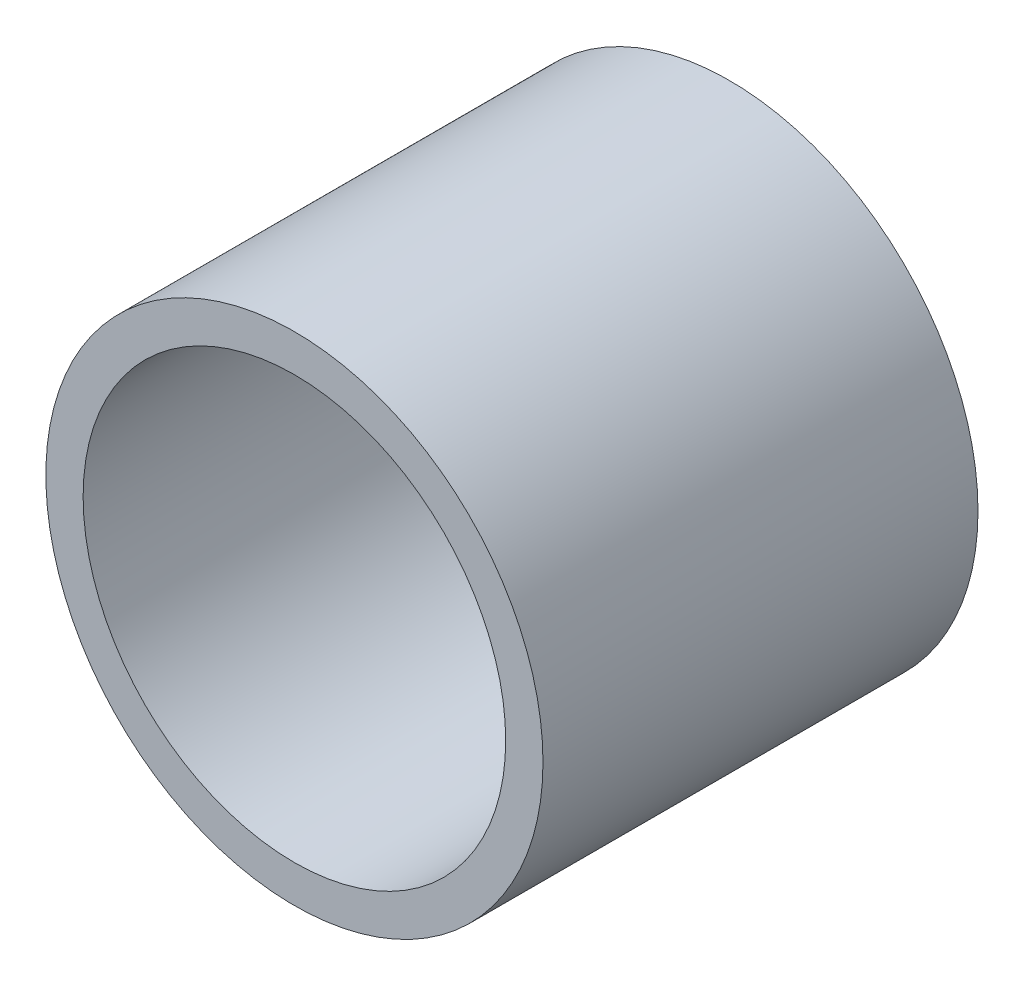
ISO-10303-21;
HEADER;
FILE_DESCRIPTION(('STEP AP214'),'2;1');
FILE_NAME('part.step','',(''),(''),'','','');
FILE_SCHEMA(('AUTOMOTIVE_DESIGN { 1 0 10303 214 1 1 1 1 }'));
ENDSEC;
DATA;
#1=APPLICATION_CONTEXT('core data for automotive mechanical design processes');
#2=APPLICATION_PROTOCOL_DEFINITION('international standard','automotive_design',2000,#1);
#3=PRODUCT_CONTEXT('',#1,'mechanical');
#4=PRODUCT('Part','Part','',(#3));
#5=PRODUCT_RELATED_PRODUCT_CATEGORY('part','',(#4));
#6=PRODUCT_DEFINITION_FORMATION('','',#4);
#7=PRODUCT_DEFINITION_CONTEXT('part definition',#1,'design');
#8=PRODUCT_DEFINITION('design','',#6,#7);
#9=PRODUCT_DEFINITION_SHAPE('','',#8);
#10=(LENGTH_UNIT() NAMED_UNIT(*) SI_UNIT(.MILLI.,.METRE.));
#11=(NAMED_UNIT(*) PLANE_ANGLE_UNIT() SI_UNIT($,.RADIAN.));
#12=(NAMED_UNIT(*) SI_UNIT($,.STERADIAN.) SOLID_ANGLE_UNIT());
#13=UNCERTAINTY_MEASURE_WITH_UNIT(LENGTH_MEASURE(1.E-05),#10,'distance_accuracy_value','');
#14=(GEOMETRIC_REPRESENTATION_CONTEXT(3) GLOBAL_UNCERTAINTY_ASSIGNED_CONTEXT((#13)) GLOBAL_UNIT_ASSIGNED_CONTEXT((#10,
#11,#12)) REPRESENTATION_CONTEXT('',''));
#15=CARTESIAN_POINT('',(0.,0.,0.));
#16=DIRECTION('',(0.,0.,1.));
#17=DIRECTION('',(1.,0.,0.));
#18=AXIS2_PLACEMENT_3D('',#15,#16,#17);
#19=CARTESIAN_POINT('',(0.,0.,44.45));
#20=DIRECTION('',(0.,0.,1.));
#21=DIRECTION('',(1.,0.,0.));
#22=AXIS2_PLACEMENT_3D('',#19,#20,#21);
#23=PLANE('',#22);
#24=CARTESIAN_POINT('',(0.,0.,44.45));
#25=DIRECTION('',(0.,0.,1.));
#26=DIRECTION('',(1.,0.,0.));
#27=AXIS2_PLACEMENT_3D('',#24,#25,#26);
#28=CIRCLE('',#27,25.4);
#29=CARTESIAN_POINT('',(25.4,0.,44.45));
#30=VERTEX_POINT('',#29);
#31=EDGE_CURVE('E10',#30,#30,#28,.T.);
#32=ORIENTED_EDGE('',*,*,#31,.T.);
#33=EDGE_LOOP('',(#32));
#34=FACE_BOUND('',#33,.T.);
#35=CARTESIAN_POINT('',(0.,0.,44.45));
#36=DIRECTION('',(0.,0.,1.));
#37=DIRECTION('',(1.,0.,0.));
#38=AXIS2_PLACEMENT_3D('',#35,#36,#37);
#39=CIRCLE('',#38,21.59);
#40=CARTESIAN_POINT('',(21.59,0.,44.45));
#41=VERTEX_POINT('',#40);
#42=EDGE_CURVE('E42',#41,#41,#39,.T.);
#43=ORIENTED_EDGE('',*,*,#42,.F.);
#44=EDGE_LOOP('',(#43));
#45=FACE_BOUND('',#44,.T.);
#46=ADVANCED_FACE('F31',(#34,#45),#23,.T.);
#47=CARTESIAN_POINT('',(0.,0.,0.));
#48=DIRECTION('',(0.,0.,1.));
#49=DIRECTION('',(1.,0.,0.));
#50=AXIS2_PLACEMENT_3D('',#47,#48,#49);
#51=PLANE('',#50);
#52=CARTESIAN_POINT('',(0.,0.,0.));
#53=DIRECTION('',(0.,0.,1.));
#54=DIRECTION('',(1.,0.,0.));
#55=AXIS2_PLACEMENT_3D('',#52,#53,#54);
#56=CIRCLE('',#55,25.4);
#57=CARTESIAN_POINT('',(25.4,0.,0.));
#58=VERTEX_POINT('',#57);
#59=EDGE_CURVE('E35',#58,#58,#56,.T.);
#60=ORIENTED_EDGE('',*,*,#59,.F.);
#61=EDGE_LOOP('',(#60));
#62=FACE_BOUND('',#61,.T.);
#63=CARTESIAN_POINT('',(0.,0.,0.));
#64=DIRECTION('',(0.,0.,1.));
#65=DIRECTION('',(1.,0.,0.));
#66=AXIS2_PLACEMENT_3D('',#63,#64,#65);
#67=CIRCLE('',#66,21.59);
#68=CARTESIAN_POINT('',(21.59,0.,0.));
#69=VERTEX_POINT('',#68);
#70=EDGE_CURVE('E44',#69,#69,#67,.T.);
#71=ORIENTED_EDGE('',*,*,#70,.T.);
#72=EDGE_LOOP('',(#71));
#73=FACE_BOUND('',#72,.T.);
#74=ADVANCED_FACE('F54',(#62,#73),#51,.F.);
#75=CARTESIAN_POINT('',(0.,0.,44.45));
#76=DIRECTION('',(0.,0.,-1.));
#77=DIRECTION('',(-1.,0.,0.));
#78=AXIS2_PLACEMENT_3D('',#75,#76,#77);
#79=CYLINDRICAL_SURFACE('',#78,25.4);
#80=ORIENTED_EDGE('',*,*,#31,.F.);
#81=EDGE_LOOP('',(#80));
#82=FACE_BOUND('',#81,.T.);
#83=ORIENTED_EDGE('',*,*,#59,.T.);
#84=EDGE_LOOP('',(#83));
#85=FACE_BOUND('',#84,.T.);
#86=ADVANCED_FACE('F33',(#82,#85),#79,.T.);
#87=CARTESIAN_POINT('',(0.,0.,44.45));
#88=DIRECTION('',(0.,0.,-1.));
#89=DIRECTION('',(-1.,0.,0.));
#90=AXIS2_PLACEMENT_3D('',#87,#88,#89);
#91=CYLINDRICAL_SURFACE('',#90,21.59);
#92=ORIENTED_EDGE('',*,*,#42,.T.);
#93=EDGE_LOOP('',(#92));
#94=FACE_BOUND('',#93,.T.);
#95=ORIENTED_EDGE('',*,*,#70,.F.);
#96=EDGE_LOOP('',(#95));
#97=FACE_BOUND('',#96,.T.);
#98=ADVANCED_FACE('F50',(#94,#97),#91,.F.);
#99=CLOSED_SHELL('',(#46,#74,#86,#98));
#100=MANIFOLD_SOLID_BREP('B2',#99);
#101=ADVANCED_BREP_SHAPE_REPRESENTATION('',(#18,#100),#14);
#102=SHAPE_DEFINITION_REPRESENTATION(#9,#101);
ENDSEC;
END-ISO-10303-21;
